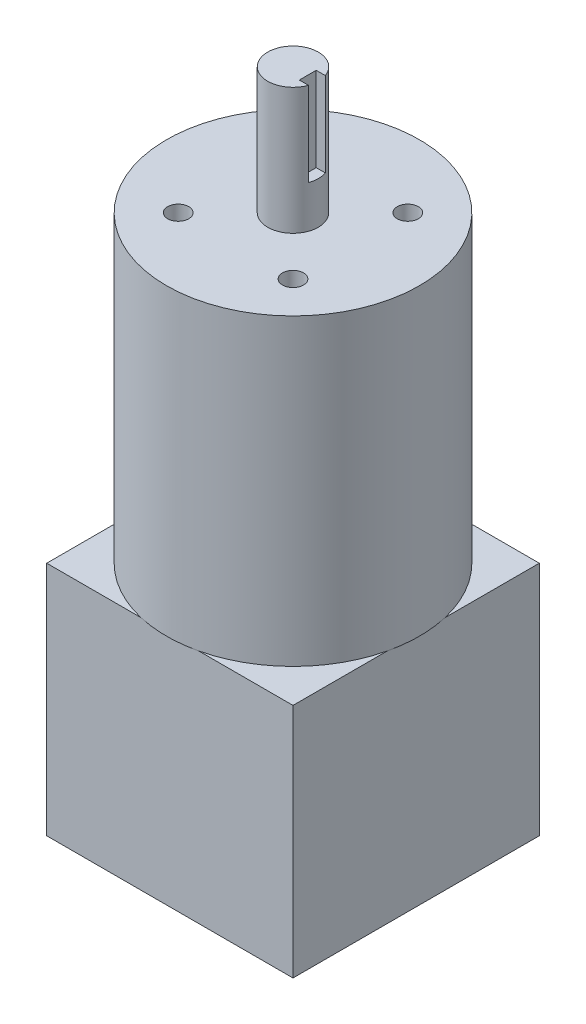
ISO-10303-21;
HEADER;
FILE_DESCRIPTION(('STEP AP214'),'2;1');
FILE_NAME('part.step','',(''),(''),'','','');
FILE_SCHEMA(('AUTOMOTIVE_DESIGN { 1 0 10303 214 1 1 1 1 }'));
ENDSEC;
DATA;
#1=APPLICATION_CONTEXT('core data for automotive mechanical design processes');
#2=APPLICATION_PROTOCOL_DEFINITION('international standard','automotive_design',2000,#1);
#3=PRODUCT_CONTEXT('',#1,'mechanical');
#4=PRODUCT('Part','Part','',(#3));
#5=PRODUCT_RELATED_PRODUCT_CATEGORY('part','',(#4));
#6=PRODUCT_DEFINITION_FORMATION('','',#4);
#7=PRODUCT_DEFINITION_CONTEXT('part definition',#1,'design');
#8=PRODUCT_DEFINITION('design','',#6,#7);
#9=PRODUCT_DEFINITION_SHAPE('','',#8);
#10=(LENGTH_UNIT() NAMED_UNIT(*) SI_UNIT(.MILLI.,.METRE.));
#11=(NAMED_UNIT(*) PLANE_ANGLE_UNIT() SI_UNIT($,.RADIAN.));
#12=(NAMED_UNIT(*) SI_UNIT($,.STERADIAN.) SOLID_ANGLE_UNIT());
#13=UNCERTAINTY_MEASURE_WITH_UNIT(LENGTH_MEASURE(1.E-05),#10,'distance_accuracy_value','');
#14=(GEOMETRIC_REPRESENTATION_CONTEXT(3) GLOBAL_UNCERTAINTY_ASSIGNED_CONTEXT((#13)) GLOBAL_UNIT_ASSIGNED_CONTEXT((#10,
#11,#12)) REPRESENTATION_CONTEXT('',''));
#15=CARTESIAN_POINT('',(0.,0.,0.));
#16=DIRECTION('',(0.,0.,1.));
#17=DIRECTION('',(1.,0.,0.));
#18=AXIS2_PLACEMENT_3D('',#15,#16,#17);
#19=CARTESIAN_POINT('',(0.,56.,0.));
#20=DIRECTION('',(0.,-1.,0.));
#21=DIRECTION('',(0.,0.,-1.));
#22=AXIS2_PLACEMENT_3D('',#19,#20,#21);
#23=PLANE('',#22);
#24=CARTESIAN_POINT('',(0.,56.,0.));
#25=DIRECTION('',(0.,1.,0.));
#26=DIRECTION('',(0.,0.,1.));
#27=AXIS2_PLACEMENT_3D('',#24,#25,#26);
#28=CIRCLE('',#27,30.);
#29=CARTESIAN_POINT('',(6.83929089891636,56.,29.21));
#30=VERTEX_POINT('',#29);
#31=CARTESIAN_POINT('',(29.21,56.,6.83929089891638));
#32=VERTEX_POINT('',#31);
#33=EDGE_CURVE('E62',#30,#32,#28,.T.);
#34=ORIENTED_EDGE('',*,*,#33,.F.);
#35=DIRECTION('',(1.,0.,0.));
#36=VECTOR('',#35,1.);
#37=CARTESIAN_POINT('',(-29.21,56.,29.21));
#38=LINE('',#37,#36);
#39=CARTESIAN_POINT('',(29.21,56.,29.21));
#40=VERTEX_POINT('',#39);
#41=EDGE_CURVE('E235',#30,#40,#38,.T.);
#42=ORIENTED_EDGE('',*,*,#41,.T.);
#43=DIRECTION('',(0.,0.,-1.));
#44=VECTOR('',#43,1.);
#45=CARTESIAN_POINT('',(29.21,56.,29.21));
#46=LINE('',#45,#44);
#47=EDGE_CURVE('E219',#40,#32,#46,.T.);
#48=ORIENTED_EDGE('',*,*,#47,.T.);
#49=EDGE_LOOP('',(#34,#42,#48));
#50=FACE_BOUND('',#49,.T.);
#51=ADVANCED_FACE('F38',(#50),#23,.F.);
#52=CARTESIAN_POINT('',(29.21,56.,-6.83929089891638));
#53=VERTEX_POINT('',#52);
#54=CARTESIAN_POINT('',(6.83929089891638,56.,-29.21));
#55=VERTEX_POINT('',#54);
#56=EDGE_CURVE('E209',#53,#55,#28,.T.);
#57=ORIENTED_EDGE('',*,*,#56,.F.);
#58=CARTESIAN_POINT('',(29.21,56.,-29.21));
#59=VERTEX_POINT('',#58);
#60=EDGE_CURVE('E224',#53,#59,#46,.T.);
#61=ORIENTED_EDGE('',*,*,#60,.T.);
#62=DIRECTION('',(-1.,0.,0.));
#63=VECTOR('',#62,1.);
#64=CARTESIAN_POINT('',(-29.21,56.,-29.21));
#65=LINE('',#64,#63);
#66=EDGE_CURVE('E225',#59,#55,#65,.T.);
#67=ORIENTED_EDGE('',*,*,#66,.T.);
#68=EDGE_LOOP('',(#57,#61,#67));
#69=FACE_BOUND('',#68,.T.);
#70=ADVANCED_FACE('F331',(#69),#23,.F.);
#71=CARTESIAN_POINT('',(-6.83929089891638,56.,-29.21));
#72=VERTEX_POINT('',#71);
#73=CARTESIAN_POINT('',(-29.21,56.,-6.83929089891635));
#74=VERTEX_POINT('',#73);
#75=EDGE_CURVE('E314',#72,#74,#28,.T.);
#76=ORIENTED_EDGE('',*,*,#75,.F.);
#77=CARTESIAN_POINT('',(-29.21,56.,-29.21));
#78=VERTEX_POINT('',#77);
#79=EDGE_CURVE('E222',#72,#78,#65,.T.);
#80=ORIENTED_EDGE('',*,*,#79,.T.);
#81=DIRECTION('',(0.,0.,1.));
#82=VECTOR('',#81,1.);
#83=CARTESIAN_POINT('',(-29.21,56.,29.21));
#84=LINE('',#83,#82);
#85=EDGE_CURVE('E231',#78,#74,#84,.T.);
#86=ORIENTED_EDGE('',*,*,#85,.T.);
#87=EDGE_LOOP('',(#76,#80,#86));
#88=FACE_BOUND('',#87,.T.);
#89=ADVANCED_FACE('F351',(#88),#23,.F.);
#90=CARTESIAN_POINT('',(29.21,56.,29.21));
#91=DIRECTION('',(-1.,0.,0.));
#92=DIRECTION('',(0.,0.,1.));
#93=AXIS2_PLACEMENT_3D('',#90,#91,#92);
#94=PLANE('',#93);
#95=DIRECTION('',(0.,0.,-1.));
#96=VECTOR('',#95,1.);
#97=CARTESIAN_POINT('',(29.21,0.,29.21));
#98=LINE('',#97,#96);
#99=CARTESIAN_POINT('',(29.21,0.,29.21));
#100=VERTEX_POINT('',#99);
#101=CARTESIAN_POINT('',(29.21,0.,-29.21));
#102=VERTEX_POINT('',#101);
#103=EDGE_CURVE('E214',#100,#102,#98,.T.);
#104=ORIENTED_EDGE('',*,*,#103,.T.);
#105=DIRECTION('',(0.,-1.,0.));
#106=VECTOR('',#105,1.);
#107=CARTESIAN_POINT('',(29.21,56.,-29.21));
#108=LINE('',#107,#106);
#109=EDGE_CURVE('E265',#59,#102,#108,.T.);
#110=ORIENTED_EDGE('',*,*,#109,.F.);
#111=ORIENTED_EDGE('',*,*,#60,.F.);
#112=EDGE_CURVE('E223',#32,#53,#46,.T.);
#113=ORIENTED_EDGE('',*,*,#112,.F.);
#114=ORIENTED_EDGE('',*,*,#47,.F.);
#115=DIRECTION('',(0.,-1.,0.));
#116=VECTOR('',#115,1.);
#117=CARTESIAN_POINT('',(29.21,56.,29.21));
#118=LINE('',#117,#116);
#119=EDGE_CURVE('E240',#40,#100,#118,.T.);
#120=ORIENTED_EDGE('',*,*,#119,.T.);
#121=EDGE_LOOP('',(#104,#110,#111,#113,#114,#120));
#122=FACE_BOUND('',#121,.T.);
#123=ADVANCED_FACE('F40',(#122),#94,.F.);
#124=CARTESIAN_POINT('',(-29.21,56.,-29.21));
#125=DIRECTION('',(0.,0.,1.));
#126=DIRECTION('',(1.,0.,0.));
#127=AXIS2_PLACEMENT_3D('',#124,#125,#126);
#128=PLANE('',#127);
#129=DIRECTION('',(-1.,0.,0.));
#130=VECTOR('',#129,1.);
#131=CARTESIAN_POINT('',(-29.21,0.,-29.21));
#132=LINE('',#131,#130);
#133=CARTESIAN_POINT('',(-29.21,0.,-29.21));
#134=VERTEX_POINT('',#133);
#135=EDGE_CURVE('E245',#102,#134,#132,.T.);
#136=ORIENTED_EDGE('',*,*,#135,.T.);
#137=DIRECTION('',(0.,-1.,0.));
#138=VECTOR('',#137,1.);
#139=CARTESIAN_POINT('',(-29.21,56.,-29.21));
#140=LINE('',#139,#138);
#141=EDGE_CURVE('E261',#78,#134,#140,.T.);
#142=ORIENTED_EDGE('',*,*,#141,.F.);
#143=ORIENTED_EDGE('',*,*,#79,.F.);
#144=EDGE_CURVE('E230',#55,#72,#65,.T.);
#145=ORIENTED_EDGE('',*,*,#144,.F.);
#146=ORIENTED_EDGE('',*,*,#66,.F.);
#147=ORIENTED_EDGE('',*,*,#109,.T.);
#148=EDGE_LOOP('',(#136,#142,#143,#145,#146,#147));
#149=FACE_BOUND('',#148,.T.);
#150=ADVANCED_FACE('F335',(#149),#128,.F.);
#151=CARTESIAN_POINT('',(-29.21,56.,29.21));
#152=DIRECTION('',(1.,0.,0.));
#153=DIRECTION('',(0.,0.,-1.));
#154=AXIS2_PLACEMENT_3D('',#151,#152,#153);
#155=PLANE('',#154);
#156=DIRECTION('',(0.,0.,1.));
#157=VECTOR('',#156,1.);
#158=CARTESIAN_POINT('',(-29.21,0.,29.21));
#159=LINE('',#158,#157);
#160=CARTESIAN_POINT('',(-29.21,0.,29.21));
#161=VERTEX_POINT('',#160);
#162=EDGE_CURVE('E248',#134,#161,#159,.T.);
#163=ORIENTED_EDGE('',*,*,#162,.T.);
#164=DIRECTION('',(0.,-1.,0.));
#165=VECTOR('',#164,1.);
#166=CARTESIAN_POINT('',(-29.21,56.,29.21));
#167=LINE('',#166,#165);
#168=CARTESIAN_POINT('',(-29.21,56.,29.21));
#169=VERTEX_POINT('',#168);
#170=EDGE_CURVE('E257',#169,#161,#167,.T.);
#171=ORIENTED_EDGE('',*,*,#170,.F.);
#172=CARTESIAN_POINT('',(-29.21,56.,6.83929089891635));
#173=VERTEX_POINT('',#172);
#174=EDGE_CURVE('E229',#173,#169,#84,.T.);
#175=ORIENTED_EDGE('',*,*,#174,.F.);
#176=EDGE_CURVE('E236',#74,#173,#84,.T.);
#177=ORIENTED_EDGE('',*,*,#176,.F.);
#178=ORIENTED_EDGE('',*,*,#85,.F.);
#179=ORIENTED_EDGE('',*,*,#141,.T.);
#180=EDGE_LOOP('',(#163,#171,#175,#177,#178,#179));
#181=FACE_BOUND('',#180,.T.);
#182=ADVANCED_FACE('F347',(#181),#155,.F.);
#183=CARTESIAN_POINT('',(-29.21,56.,29.21));
#184=DIRECTION('',(0.,0.,-1.));
#185=DIRECTION('',(-1.,0.,0.));
#186=AXIS2_PLACEMENT_3D('',#183,#184,#185);
#187=PLANE('',#186);
#188=DIRECTION('',(1.,0.,0.));
#189=VECTOR('',#188,1.);
#190=CARTESIAN_POINT('',(-29.21,0.,29.21));
#191=LINE('',#190,#189);
#192=EDGE_CURVE('E251',#161,#100,#191,.T.);
#193=ORIENTED_EDGE('',*,*,#192,.T.);
#194=ORIENTED_EDGE('',*,*,#119,.F.);
#195=ORIENTED_EDGE('',*,*,#41,.F.);
#196=CARTESIAN_POINT('',(-6.83929089891636,56.,29.21));
#197=VERTEX_POINT('',#196);
#198=EDGE_CURVE('E241',#197,#30,#38,.T.);
#199=ORIENTED_EDGE('',*,*,#198,.F.);
#200=EDGE_CURVE('E237',#169,#197,#38,.T.);
#201=ORIENTED_EDGE('',*,*,#200,.F.);
#202=ORIENTED_EDGE('',*,*,#170,.T.);
#203=EDGE_LOOP('',(#193,#194,#195,#199,#201,#202));
#204=FACE_BOUND('',#203,.T.);
#205=ADVANCED_FACE('F371',(#204),#187,.F.);
#206=EDGE_CURVE('E218',#173,#197,#28,.T.);
#207=ORIENTED_EDGE('',*,*,#206,.F.);
#208=ORIENTED_EDGE('',*,*,#174,.T.);
#209=ORIENTED_EDGE('',*,*,#200,.T.);
#210=EDGE_LOOP('',(#207,#208,#209));
#211=FACE_BOUND('',#210,.T.);
#212=ADVANCED_FACE('F365',(#211),#23,.F.);
#213=CARTESIAN_POINT('',(0.,0.,0.));
#214=DIRECTION('',(0.,-1.,0.));
#215=DIRECTION('',(0.,0.,-1.));
#216=AXIS2_PLACEMENT_3D('',#213,#214,#215);
#217=PLANE('',#216);
#218=ORIENTED_EDGE('',*,*,#103,.F.);
#219=ORIENTED_EDGE('',*,*,#192,.F.);
#220=ORIENTED_EDGE('',*,*,#162,.F.);
#221=ORIENTED_EDGE('',*,*,#135,.F.);
#222=EDGE_LOOP('',(#218,#219,#220,#221));
#223=FACE_BOUND('',#222,.T.);
#224=ADVANCED_FACE('F342',(#223),#217,.T.);
#225=CARTESIAN_POINT('',(0.,56.,0.));
#226=DIRECTION('',(0.,1.,0.));
#227=DIRECTION('',(0.,0.,1.));
#228=AXIS2_PLACEMENT_3D('',#225,#226,#227);
#229=PLANE('',#228);
#230=EDGE_CURVE('E217',#32,#53,#28,.T.);
#231=ORIENTED_EDGE('',*,*,#230,.F.);
#232=ORIENTED_EDGE('',*,*,#112,.T.);
#233=EDGE_LOOP('',(#231,#232));
#234=FACE_BOUND('',#233,.T.);
#235=ADVANCED_FACE('F361',(#234),#229,.F.);
#236=EDGE_CURVE('E306',#55,#72,#28,.T.);
#237=ORIENTED_EDGE('',*,*,#236,.F.);
#238=ORIENTED_EDGE('',*,*,#144,.T.);
#239=EDGE_LOOP('',(#237,#238));
#240=FACE_BOUND('',#239,.T.);
#241=ADVANCED_FACE('F355',(#240),#229,.F.);
#242=EDGE_CURVE('E304',#74,#173,#28,.T.);
#243=ORIENTED_EDGE('',*,*,#242,.F.);
#244=ORIENTED_EDGE('',*,*,#176,.T.);
#245=EDGE_LOOP('',(#243,#244));
#246=FACE_BOUND('',#245,.T.);
#247=ADVANCED_FACE('F353',(#246),#229,.F.);
#248=EDGE_CURVE('E204',#197,#30,#28,.T.);
#249=ORIENTED_EDGE('',*,*,#248,.F.);
#250=ORIENTED_EDGE('',*,*,#198,.T.);
#251=EDGE_LOOP('',(#249,#250));
#252=FACE_BOUND('',#251,.T.);
#253=ADVANCED_FACE('F292',(#252),#229,.F.);
#254=CARTESIAN_POINT('',(0.,128.,0.));
#255=DIRECTION('',(0.,-1.,0.));
#256=DIRECTION('',(0.,0.,-1.));
#257=AXIS2_PLACEMENT_3D('',#254,#255,#256);
#258=CYLINDRICAL_SURFACE('',#257,30.);
#259=CARTESIAN_POINT('',(0.,128.,0.));
#260=DIRECTION('',(0.,1.,0.));
#261=DIRECTION('',(0.,0.,1.));
#262=AXIS2_PLACEMENT_3D('',#259,#260,#261);
#263=CIRCLE('',#262,30.);
#264=CARTESIAN_POINT('',(0.,128.,30.));
#265=VERTEX_POINT('',#264);
#266=EDGE_CURVE('E210',#265,#265,#263,.T.);
#267=ORIENTED_EDGE('',*,*,#266,.F.);
#268=EDGE_LOOP('',(#267));
#269=FACE_BOUND('',#268,.T.);
#270=ORIENTED_EDGE('',*,*,#33,.T.);
#271=ORIENTED_EDGE('',*,*,#230,.T.);
#272=ORIENTED_EDGE('',*,*,#56,.T.);
#273=ORIENTED_EDGE('',*,*,#236,.T.);
#274=ORIENTED_EDGE('',*,*,#75,.T.);
#275=ORIENTED_EDGE('',*,*,#242,.T.);
#276=ORIENTED_EDGE('',*,*,#206,.T.);
#277=ORIENTED_EDGE('',*,*,#248,.T.);
#278=EDGE_LOOP('',(#270,#271,#272,#273,#274,#275,#276,#277));
#279=FACE_BOUND('',#278,.T.);
#280=ADVANCED_FACE('F285',(#269,#279),#258,.T.);
#281=CARTESIAN_POINT('',(0.,128.,0.));
#282=DIRECTION('',(0.,1.,0.));
#283=DIRECTION('',(0.,0.,1.));
#284=AXIS2_PLACEMENT_3D('',#281,#282,#283);
#285=PLANE('',#284);
#286=CARTESIAN_POINT('',(-13.6118055378411,128.,13.611805537841));
#287=DIRECTION('',(0.,1.,0.));
#288=DIRECTION('',(0.,0.,-1.));
#289=AXIS2_PLACEMENT_3D('',#286,#287,#288);
#290=CIRCLE('',#289,2.49999999999999);
#291=CARTESIAN_POINT('',(-13.6118055378411,128.,11.111805537841));
#292=VERTEX_POINT('',#291);
#293=EDGE_CURVE('E168',#292,#292,#290,.T.);
#294=ORIENTED_EDGE('',*,*,#293,.F.);
#295=EDGE_LOOP('',(#294));
#296=FACE_BOUND('',#295,.T.);
#297=CARTESIAN_POINT('',(13.6118055378411,128.,13.611805537841));
#298=DIRECTION('',(0.,1.,0.));
#299=DIRECTION('',(0.,0.,1.));
#300=AXIS2_PLACEMENT_3D('',#297,#298,#299);
#301=CIRCLE('',#300,2.49999999999999);
#302=CARTESIAN_POINT('',(13.6118055378411,128.,16.111805537841));
#303=VERTEX_POINT('',#302);
#304=EDGE_CURVE('E182',#303,#303,#301,.T.);
#305=ORIENTED_EDGE('',*,*,#304,.F.);
#306=EDGE_LOOP('',(#305));
#307=FACE_BOUND('',#306,.T.);
#308=CARTESIAN_POINT('',(13.6118055378411,128.,-13.611805537841));
#309=DIRECTION('',(0.,1.,0.));
#310=DIRECTION('',(0.,0.,-1.));
#311=AXIS2_PLACEMENT_3D('',#308,#309,#310);
#312=CIRCLE('',#311,2.49999999999999);
#313=CARTESIAN_POINT('',(13.6118055378411,128.,-16.111805537841));
#314=VERTEX_POINT('',#313);
#315=EDGE_CURVE('E174',#314,#314,#312,.T.);
#316=ORIENTED_EDGE('',*,*,#315,.F.);
#317=EDGE_LOOP('',(#316));
#318=FACE_BOUND('',#317,.T.);
#319=CARTESIAN_POINT('',(-13.6118055378411,128.,-13.611805537841));
#320=DIRECTION('',(0.,1.,0.));
#321=DIRECTION('',(0.,0.,1.));
#322=AXIS2_PLACEMENT_3D('',#319,#320,#321);
#323=CIRCLE('',#322,2.49999999999999);
#324=CARTESIAN_POINT('',(-13.6118055378411,128.,-11.111805537841));
#325=VERTEX_POINT('',#324);
#326=EDGE_CURVE('E173',#325,#325,#323,.T.);
#327=ORIENTED_EDGE('',*,*,#326,.F.);
#328=EDGE_LOOP('',(#327));
#329=FACE_BOUND('',#328,.T.);
#330=CARTESIAN_POINT('',(0.,128.,0.));
#331=DIRECTION('',(0.,1.,0.));
#332=DIRECTION('',(0.,0.,1.));
#333=AXIS2_PLACEMENT_3D('',#330,#331,#332);
#334=CIRCLE('',#333,6.);
#335=CARTESIAN_POINT('',(0.,128.,6.));
#336=VERTEX_POINT('',#335);
#337=EDGE_CURVE('E205',#336,#336,#334,.T.);
#338=ORIENTED_EDGE('',*,*,#337,.F.);
#339=EDGE_LOOP('',(#338));
#340=FACE_BOUND('',#339,.T.);
#341=ORIENTED_EDGE('',*,*,#266,.T.);
#342=EDGE_LOOP('',(#341));
#343=FACE_BOUND('',#342,.T.);
#344=ADVANCED_FACE('F279',(#296,#307,#318,#329,#340,#343),#285,.T.);
#345=CARTESIAN_POINT('',(0.,158.,0.));
#346=DIRECTION('',(0.,-1.,0.));
#347=DIRECTION('',(0.,0.,-1.));
#348=AXIS2_PLACEMENT_3D('',#345,#346,#347);
#349=CYLINDRICAL_SURFACE('',#348,6.);
#350=CARTESIAN_POINT('',(0.,158.,0.));
#351=DIRECTION('',(0.,1.,0.));
#352=DIRECTION('',(0.,0.,1.));
#353=AXIS2_PLACEMENT_3D('',#350,#351,#352);
#354=CIRCLE('',#353,6.);
#355=CARTESIAN_POINT('',(5.65685424949238,158.,-2.));
#356=VERTEX_POINT('',#355);
#357=CARTESIAN_POINT('',(5.65685424949238,158.,2.));
#358=VERTEX_POINT('',#357);
#359=EDGE_CURVE('E197',#356,#358,#354,.T.);
#360=ORIENTED_EDGE('',*,*,#359,.F.);
#361=DIRECTION('',(0.,-1.,0.));
#362=VECTOR('',#361,1.);
#363=CARTESIAN_POINT('',(5.65685424949238,158.,-2.));
#364=LINE('',#363,#362);
#365=CARTESIAN_POINT('',(5.65685424949238,138.,-2.));
#366=VERTEX_POINT('',#365);
#367=EDGE_CURVE('E164',#356,#366,#364,.T.);
#368=ORIENTED_EDGE('',*,*,#367,.T.);
#369=CARTESIAN_POINT('',(0.,138.,0.));
#370=DIRECTION('',(0.,-1.,0.));
#371=DIRECTION('',(0.,0.,-1.));
#372=AXIS2_PLACEMENT_3D('',#369,#370,#371);
#373=CIRCLE('',#372,6.);
#374=CARTESIAN_POINT('',(5.65685424949238,138.,2.));
#375=VERTEX_POINT('',#374);
#376=EDGE_CURVE('E11',#366,#375,#373,.T.);
#377=ORIENTED_EDGE('',*,*,#376,.T.);
#378=DIRECTION('',(0.,-1.,0.));
#379=VECTOR('',#378,1.);
#380=CARTESIAN_POINT('',(5.65685424949238,158.,2.));
#381=LINE('',#380,#379);
#382=EDGE_CURVE('E143',#375,#358,#381,.F.);
#383=ORIENTED_EDGE('',*,*,#382,.T.);
#384=EDGE_LOOP('',(#360,#368,#377,#383));
#385=FACE_BOUND('',#384,.T.);
#386=ORIENTED_EDGE('',*,*,#337,.T.);
#387=EDGE_LOOP('',(#386));
#388=FACE_BOUND('',#387,.T.);
#389=ADVANCED_FACE('F276',(#385,#388),#349,.T.);
#390=CARTESIAN_POINT('',(0.,158.,0.));
#391=DIRECTION('',(0.,1.,0.));
#392=DIRECTION('',(0.,0.,1.));
#393=AXIS2_PLACEMENT_3D('',#390,#391,#392);
#394=PLANE('',#393);
#395=DIRECTION('',(-1.,0.,0.));
#396=VECTOR('',#395,1.);
#397=CARTESIAN_POINT('',(0.,158.,-2.));
#398=LINE('',#397,#396);
#399=CARTESIAN_POINT('',(3.5,158.,-2.));
#400=VERTEX_POINT('',#399);
#401=EDGE_CURVE('E47',#356,#400,#398,.T.);
#402=ORIENTED_EDGE('',*,*,#401,.F.);
#403=ORIENTED_EDGE('',*,*,#359,.T.);
#404=DIRECTION('',(1.,0.,0.));
#405=VECTOR('',#404,1.);
#406=CARTESIAN_POINT('',(6.,158.,2.));
#407=LINE('',#406,#405);
#408=CARTESIAN_POINT('',(3.5,158.,2.));
#409=VERTEX_POINT('',#408);
#410=EDGE_CURVE('E151',#409,#358,#407,.T.);
#411=ORIENTED_EDGE('',*,*,#410,.F.);
#412=DIRECTION('',(0.,0.,1.));
#413=VECTOR('',#412,1.);
#414=CARTESIAN_POINT('',(3.5,158.,-2.));
#415=LINE('',#414,#413);
#416=EDGE_CURVE('E54',#400,#409,#415,.T.);
#417=ORIENTED_EDGE('',*,*,#416,.F.);
#418=EDGE_LOOP('',(#402,#403,#411,#417));
#419=FACE_BOUND('',#418,.T.);
#420=ADVANCED_FACE('F274',(#419),#394,.T.);
#421=CARTESIAN_POINT('',(-13.6118055378411,102.6,-13.611805537841));
#422=DIRECTION('',(0.,1.,0.));
#423=DIRECTION('',(0.,0.,1.));
#424=AXIS2_PLACEMENT_3D('',#421,#422,#423);
#425=CYLINDRICAL_SURFACE('',#424,2.49999999999999);
#426=CARTESIAN_POINT('',(-13.6118055378411,102.6,-13.611805537841));
#427=DIRECTION('',(0.,1.,0.));
#428=DIRECTION('',(0.,0.,1.));
#429=AXIS2_PLACEMENT_3D('',#426,#427,#428);
#430=CIRCLE('',#429,2.49999999999999);
#431=CARTESIAN_POINT('',(-13.6118055378411,102.6,-11.111805537841));
#432=VERTEX_POINT('',#431);
#433=EDGE_CURVE('E193',#432,#432,#430,.T.);
#434=ORIENTED_EDGE('',*,*,#433,.F.);
#435=EDGE_LOOP('',(#434));
#436=FACE_BOUND('',#435,.T.);
#437=ORIENTED_EDGE('',*,*,#326,.T.);
#438=EDGE_LOOP('',(#437));
#439=FACE_BOUND('',#438,.T.);
#440=ADVANCED_FACE('F445',(#436,#439),#425,.F.);
#441=CARTESIAN_POINT('',(-13.6118055378411,102.6,-13.611805537841));
#442=DIRECTION('',(0.,1.,0.));
#443=DIRECTION('',(0.,0.,1.));
#444=AXIS2_PLACEMENT_3D('',#441,#442,#443);
#445=PLANE('',#444);
#446=ORIENTED_EDGE('',*,*,#433,.T.);
#447=EDGE_LOOP('',(#446));
#448=FACE_BOUND('',#447,.T.);
#449=ADVANCED_FACE('F450',(#448),#445,.T.);
#450=CARTESIAN_POINT('',(13.6118055378411,102.6,-13.611805537841));
#451=DIRECTION('',(0.,1.,0.));
#452=DIRECTION('',(0.,0.,1.));
#453=AXIS2_PLACEMENT_3D('',#450,#451,#452);
#454=CYLINDRICAL_SURFACE('',#453,2.49999999999999);
#455=CARTESIAN_POINT('',(13.6118055378411,102.6,-13.611805537841));
#456=DIRECTION('',(0.,1.,0.));
#457=DIRECTION('',(0.,0.,-1.));
#458=AXIS2_PLACEMENT_3D('',#455,#456,#457);
#459=CIRCLE('',#458,2.49999999999999);
#460=CARTESIAN_POINT('',(13.6118055378411,102.6,-16.111805537841));
#461=VERTEX_POINT('',#460);
#462=EDGE_CURVE('E169',#461,#461,#459,.T.);
#463=ORIENTED_EDGE('',*,*,#462,.F.);
#464=EDGE_LOOP('',(#463));
#465=FACE_BOUND('',#464,.T.);
#466=ORIENTED_EDGE('',*,*,#315,.T.);
#467=EDGE_LOOP('',(#466));
#468=FACE_BOUND('',#467,.T.);
#469=ADVANCED_FACE('F462',(#465,#468),#454,.F.);
#470=CARTESIAN_POINT('',(13.6118055378411,102.6,-13.611805537841));
#471=DIRECTION('',(0.,-1.,0.));
#472=DIRECTION('',(0.,0.,-1.));
#473=AXIS2_PLACEMENT_3D('',#470,#471,#472);
#474=PLANE('',#473);
#475=ORIENTED_EDGE('',*,*,#462,.T.);
#476=EDGE_LOOP('',(#475));
#477=FACE_BOUND('',#476,.T.);
#478=ADVANCED_FACE('F472',(#477),#474,.F.);
#479=CARTESIAN_POINT('',(13.6118055378411,102.6,13.611805537841));
#480=DIRECTION('',(0.,1.,0.));
#481=DIRECTION('',(0.,0.,1.));
#482=AXIS2_PLACEMENT_3D('',#479,#480,#481);
#483=CYLINDRICAL_SURFACE('',#482,2.49999999999999);
#484=CARTESIAN_POINT('',(13.6118055378411,102.6,13.611805537841));
#485=DIRECTION('',(0.,1.,0.));
#486=DIRECTION('',(0.,0.,1.));
#487=AXIS2_PLACEMENT_3D('',#484,#485,#486);
#488=CIRCLE('',#487,2.49999999999999);
#489=CARTESIAN_POINT('',(13.6118055378411,102.6,16.111805537841));
#490=VERTEX_POINT('',#489);
#491=EDGE_CURVE('E178',#490,#490,#488,.T.);
#492=ORIENTED_EDGE('',*,*,#491,.F.);
#493=EDGE_LOOP('',(#492));
#494=FACE_BOUND('',#493,.T.);
#495=ORIENTED_EDGE('',*,*,#304,.T.);
#496=EDGE_LOOP('',(#495));
#497=FACE_BOUND('',#496,.T.);
#498=ADVANCED_FACE('F482',(#494,#497),#483,.F.);
#499=CARTESIAN_POINT('',(13.6118055378411,102.6,13.611805537841));
#500=DIRECTION('',(0.,1.,0.));
#501=DIRECTION('',(0.,0.,1.));
#502=AXIS2_PLACEMENT_3D('',#499,#500,#501);
#503=PLANE('',#502);
#504=ORIENTED_EDGE('',*,*,#491,.T.);
#505=EDGE_LOOP('',(#504));
#506=FACE_BOUND('',#505,.T.);
#507=ADVANCED_FACE('F492',(#506),#503,.T.);
#508=CARTESIAN_POINT('',(-13.6118055378411,102.6,13.611805537841));
#509=DIRECTION('',(0.,1.,0.));
#510=DIRECTION('',(0.,0.,1.));
#511=AXIS2_PLACEMENT_3D('',#508,#509,#510);
#512=CYLINDRICAL_SURFACE('',#511,2.49999999999999);
#513=CARTESIAN_POINT('',(-13.6118055378411,102.6,13.611805537841));
#514=DIRECTION('',(0.,1.,0.));
#515=DIRECTION('',(0.,0.,-1.));
#516=AXIS2_PLACEMENT_3D('',#513,#514,#515);
#517=CIRCLE('',#516,2.49999999999999);
#518=CARTESIAN_POINT('',(-13.6118055378411,102.6,11.111805537841));
#519=VERTEX_POINT('',#518);
#520=EDGE_CURVE('E186',#519,#519,#517,.T.);
#521=ORIENTED_EDGE('',*,*,#520,.F.);
#522=EDGE_LOOP('',(#521));
#523=FACE_BOUND('',#522,.T.);
#524=ORIENTED_EDGE('',*,*,#293,.T.);
#525=EDGE_LOOP('',(#524));
#526=FACE_BOUND('',#525,.T.);
#527=ADVANCED_FACE('F502',(#523,#526),#512,.F.);
#528=CARTESIAN_POINT('',(-13.6118055378411,102.6,13.611805537841));
#529=DIRECTION('',(0.,-1.,0.));
#530=DIRECTION('',(0.,0.,-1.));
#531=AXIS2_PLACEMENT_3D('',#528,#529,#530);
#532=PLANE('',#531);
#533=ORIENTED_EDGE('',*,*,#520,.T.);
#534=EDGE_LOOP('',(#533));
#535=FACE_BOUND('',#534,.T.);
#536=ADVANCED_FACE('F512',(#535),#532,.F.);
#537=CARTESIAN_POINT('',(0.,138.,0.));
#538=DIRECTION('',(0.,-1.,0.));
#539=DIRECTION('',(0.,0.,-1.));
#540=AXIS2_PLACEMENT_3D('',#537,#538,#539);
#541=PLANE('',#540);
#542=DIRECTION('',(-1.,0.,0.));
#543=VECTOR('',#542,1.);
#544=CARTESIAN_POINT('',(6.,138.,-2.));
#545=LINE('',#544,#543);
#546=CARTESIAN_POINT('',(3.5,138.,-2.));
#547=VERTEX_POINT('',#546);
#548=EDGE_CURVE('E137',#366,#547,#545,.T.);
#549=ORIENTED_EDGE('',*,*,#548,.T.);
#550=DIRECTION('',(0.,0.,1.));
#551=VECTOR('',#550,1.);
#552=CARTESIAN_POINT('',(3.5,138.,-2.));
#553=LINE('',#552,#551);
#554=CARTESIAN_POINT('',(3.5,138.,2.));
#555=VERTEX_POINT('',#554);
#556=EDGE_CURVE('E132',#547,#555,#553,.T.);
#557=ORIENTED_EDGE('',*,*,#556,.T.);
#558=DIRECTION('',(1.,0.,0.));
#559=VECTOR('',#558,1.);
#560=CARTESIAN_POINT('',(6.,138.,2.));
#561=LINE('',#560,#559);
#562=EDGE_CURVE('E140',#555,#375,#561,.T.);
#563=ORIENTED_EDGE('',*,*,#562,.T.);
#564=ORIENTED_EDGE('',*,*,#376,.F.);
#565=EDGE_LOOP('',(#549,#557,#563,#564));
#566=FACE_BOUND('',#565,.T.);
#567=ADVANCED_FACE('F147',(#566),#541,.F.);
#568=CARTESIAN_POINT('',(6.,138.,-2.));
#569=DIRECTION('',(0.,0.,-1.));
#570=DIRECTION('',(-1.,0.,0.));
#571=AXIS2_PLACEMENT_3D('',#568,#569,#570);
#572=PLANE('',#571);
#573=ORIENTED_EDGE('',*,*,#401,.T.);
#574=DIRECTION('',(0.,1.,0.));
#575=VECTOR('',#574,1.);
#576=CARTESIAN_POINT('',(3.5,138.,-2.));
#577=LINE('',#576,#575);
#578=EDGE_CURVE('E136',#547,#400,#577,.T.);
#579=ORIENTED_EDGE('',*,*,#578,.F.);
#580=ORIENTED_EDGE('',*,*,#548,.F.);
#581=ORIENTED_EDGE('',*,*,#367,.F.);
#582=EDGE_LOOP('',(#573,#579,#580,#581));
#583=FACE_BOUND('',#582,.T.);
#584=ADVANCED_FACE('F271',(#583),#572,.F.);
#585=CARTESIAN_POINT('',(6.,138.,2.));
#586=DIRECTION('',(0.,0.,1.));
#587=DIRECTION('',(1.,0.,0.));
#588=AXIS2_PLACEMENT_3D('',#585,#586,#587);
#589=PLANE('',#588);
#590=ORIENTED_EDGE('',*,*,#562,.F.);
#591=DIRECTION('',(0.,1.,0.));
#592=VECTOR('',#591,1.);
#593=CARTESIAN_POINT('',(3.5,138.,2.));
#594=LINE('',#593,#592);
#595=EDGE_CURVE('E128',#555,#409,#594,.T.);
#596=ORIENTED_EDGE('',*,*,#595,.T.);
#597=ORIENTED_EDGE('',*,*,#410,.T.);
#598=ORIENTED_EDGE('',*,*,#382,.F.);
#599=EDGE_LOOP('',(#590,#596,#597,#598));
#600=FACE_BOUND('',#599,.T.);
#601=ADVANCED_FACE('F141',(#600),#589,.F.);
#602=CARTESIAN_POINT('',(3.5,138.,-2.));
#603=DIRECTION('',(-1.,0.,0.));
#604=DIRECTION('',(0.,0.,1.));
#605=AXIS2_PLACEMENT_3D('',#602,#603,#604);
#606=PLANE('',#605);
#607=ORIENTED_EDGE('',*,*,#416,.T.);
#608=ORIENTED_EDGE('',*,*,#595,.F.);
#609=ORIENTED_EDGE('',*,*,#556,.F.);
#610=ORIENTED_EDGE('',*,*,#578,.T.);
#611=EDGE_LOOP('',(#607,#608,#609,#610));
#612=FACE_BOUND('',#611,.T.);
#613=ADVANCED_FACE('F130',(#612),#606,.F.);
#614=CLOSED_SHELL('',(#51,#70,#89,#123,#150,#182,#205,#212,#224,#235,#241,#247,#253,#280,#344,
#389,#420,#440,#449,#469,#478,#498,#507,#527,#536,#567,#584,#601,#613));
#615=MANIFOLD_SOLID_BREP('B2',#614);
#616=ADVANCED_BREP_SHAPE_REPRESENTATION('',(#18,#615),#14);
#617=SHAPE_DEFINITION_REPRESENTATION(#9,#616);
ENDSEC;
END-ISO-10303-21;
